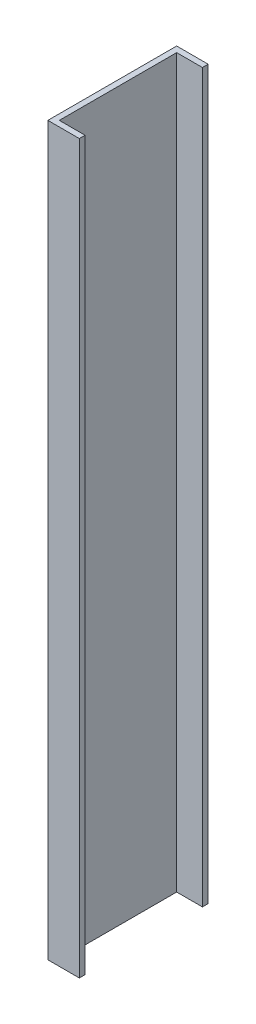
ISO-10303-21;
HEADER;
FILE_DESCRIPTION(('STEP AP214'),'2;1');
FILE_NAME('part.step','',(''),(''),'','','');
FILE_SCHEMA(('AUTOMOTIVE_DESIGN { 1 0 10303 214 1 1 1 1 }'));
ENDSEC;
DATA;
#1=APPLICATION_CONTEXT('core data for automotive mechanical design processes');
#2=APPLICATION_PROTOCOL_DEFINITION('international standard','automotive_design',2000,#1);
#3=PRODUCT_CONTEXT('',#1,'mechanical');
#4=PRODUCT('Part','Part','',(#3));
#5=PRODUCT_RELATED_PRODUCT_CATEGORY('part','',(#4));
#6=PRODUCT_DEFINITION_FORMATION('','',#4);
#7=PRODUCT_DEFINITION_CONTEXT('part definition',#1,'design');
#8=PRODUCT_DEFINITION('design','',#6,#7);
#9=PRODUCT_DEFINITION_SHAPE('','',#8);
#10=(LENGTH_UNIT() NAMED_UNIT(*) SI_UNIT(.MILLI.,.METRE.));
#11=(NAMED_UNIT(*) PLANE_ANGLE_UNIT() SI_UNIT($,.RADIAN.));
#12=(NAMED_UNIT(*) SI_UNIT($,.STERADIAN.) SOLID_ANGLE_UNIT());
#13=UNCERTAINTY_MEASURE_WITH_UNIT(LENGTH_MEASURE(1.E-05),#10,'distance_accuracy_value','');
#14=(GEOMETRIC_REPRESENTATION_CONTEXT(3) GLOBAL_UNCERTAINTY_ASSIGNED_CONTEXT((#13)) GLOBAL_UNIT_ASSIGNED_CONTEXT((#10,
#11,#12)) REPRESENTATION_CONTEXT('',''));
#15=CARTESIAN_POINT('',(0.,0.,0.));
#16=DIRECTION('',(0.,0.,1.));
#17=DIRECTION('',(1.,0.,0.));
#18=AXIS2_PLACEMENT_3D('',#15,#16,#17);
#19=CARTESIAN_POINT('',(11.,254.,0.));
#20=DIRECTION('',(0.,0.,-1.));
#21=DIRECTION('',(-1.,0.,0.));
#22=AXIS2_PLACEMENT_3D('',#19,#20,#21);
#23=PLANE('',#22);
#24=DIRECTION('',(1.,0.,0.));
#25=VECTOR('',#24,1.);
#26=CARTESIAN_POINT('',(11.,0.,0.));
#27=LINE('',#26,#25);
#28=CARTESIAN_POINT('',(0.,0.,0.));
#29=VERTEX_POINT('',#28);
#30=CARTESIAN_POINT('',(11.,0.,0.));
#31=VERTEX_POINT('',#30);
#32=EDGE_CURVE('E128',#29,#31,#27,.T.);
#33=ORIENTED_EDGE('',*,*,#32,.T.);
#34=DIRECTION('',(0.,-1.,0.));
#35=VECTOR('',#34,1.);
#36=CARTESIAN_POINT('',(11.,254.,0.));
#37=LINE('',#36,#35);
#38=CARTESIAN_POINT('',(11.,254.,0.));
#39=VERTEX_POINT('',#38);
#40=EDGE_CURVE('E11',#39,#31,#37,.T.);
#41=ORIENTED_EDGE('',*,*,#40,.F.);
#42=DIRECTION('',(1.,0.,0.));
#43=VECTOR('',#42,1.);
#44=CARTESIAN_POINT('',(11.,254.,0.));
#45=LINE('',#44,#43);
#46=CARTESIAN_POINT('',(0.,254.,0.));
#47=VERTEX_POINT('',#46);
#48=EDGE_CURVE('E142',#47,#39,#45,.T.);
#49=ORIENTED_EDGE('',*,*,#48,.F.);
#50=DIRECTION('',(0.,-1.,0.));
#51=VECTOR('',#50,1.);
#52=CARTESIAN_POINT('',(0.,254.,0.));
#53=LINE('',#52,#51);
#54=EDGE_CURVE('E124',#47,#29,#53,.T.);
#55=ORIENTED_EDGE('',*,*,#54,.T.);
#56=EDGE_LOOP('',(#33,#41,#49,#55));
#57=FACE_BOUND('',#56,.T.);
#58=ADVANCED_FACE('F32',(#57),#23,.F.);
#59=CARTESIAN_POINT('',(11.,254.,-2.));
#60=DIRECTION('',(-1.,0.,0.));
#61=DIRECTION('',(0.,0.,1.));
#62=AXIS2_PLACEMENT_3D('',#59,#60,#61);
#63=PLANE('',#62);
#64=DIRECTION('',(0.,0.,-1.));
#65=VECTOR('',#64,1.);
#66=CARTESIAN_POINT('',(11.,0.,-2.));
#67=LINE('',#66,#65);
#68=CARTESIAN_POINT('',(11.,0.,-2.));
#69=VERTEX_POINT('',#68);
#70=EDGE_CURVE('E131',#31,#69,#67,.T.);
#71=ORIENTED_EDGE('',*,*,#70,.T.);
#72=DIRECTION('',(0.,-1.,0.));
#73=VECTOR('',#72,1.);
#74=CARTESIAN_POINT('',(11.,254.,-2.));
#75=LINE('',#74,#73);
#76=CARTESIAN_POINT('',(11.,254.,-2.));
#77=VERTEX_POINT('',#76);
#78=EDGE_CURVE('E40',#77,#69,#75,.T.);
#79=ORIENTED_EDGE('',*,*,#78,.F.);
#80=DIRECTION('',(0.,0.,-1.));
#81=VECTOR('',#80,1.);
#82=CARTESIAN_POINT('',(11.,254.,-2.));
#83=LINE('',#82,#81);
#84=EDGE_CURVE('E91',#39,#77,#83,.T.);
#85=ORIENTED_EDGE('',*,*,#84,.F.);
#86=ORIENTED_EDGE('',*,*,#40,.T.);
#87=EDGE_LOOP('',(#71,#79,#85,#86));
#88=FACE_BOUND('',#87,.T.);
#89=ADVANCED_FACE('F177',(#88),#63,.F.);
#90=CARTESIAN_POINT('',(2.,254.,-2.));
#91=DIRECTION('',(0.,0.,1.));
#92=DIRECTION('',(1.,0.,0.));
#93=AXIS2_PLACEMENT_3D('',#90,#91,#92);
#94=PLANE('',#93);
#95=DIRECTION('',(-1.,0.,0.));
#96=VECTOR('',#95,1.);
#97=CARTESIAN_POINT('',(2.,0.,-2.));
#98=LINE('',#97,#96);
#99=CARTESIAN_POINT('',(2.,0.,-2.));
#100=VERTEX_POINT('',#99);
#101=EDGE_CURVE('E133',#69,#100,#98,.T.);
#102=ORIENTED_EDGE('',*,*,#101,.T.);
#103=DIRECTION('',(0.,-1.,0.));
#104=VECTOR('',#103,1.);
#105=CARTESIAN_POINT('',(2.,254.,-2.));
#106=LINE('',#105,#104);
#107=CARTESIAN_POINT('',(2.,254.,-2.));
#108=VERTEX_POINT('',#107);
#109=EDGE_CURVE('E149',#108,#100,#106,.T.);
#110=ORIENTED_EDGE('',*,*,#109,.F.);
#111=DIRECTION('',(-1.,0.,0.));
#112=VECTOR('',#111,1.);
#113=CARTESIAN_POINT('',(2.,254.,-2.));
#114=LINE('',#113,#112);
#115=EDGE_CURVE('E157',#77,#108,#114,.T.);
#116=ORIENTED_EDGE('',*,*,#115,.F.);
#117=ORIENTED_EDGE('',*,*,#78,.T.);
#118=EDGE_LOOP('',(#102,#110,#116,#117));
#119=FACE_BOUND('',#118,.T.);
#120=ADVANCED_FACE('F155',(#119),#94,.F.);
#121=CARTESIAN_POINT('',(2.,254.,-43.));
#122=DIRECTION('',(-1.,0.,0.));
#123=DIRECTION('',(0.,0.,1.));
#124=AXIS2_PLACEMENT_3D('',#121,#122,#123);
#125=PLANE('',#124);
#126=DIRECTION('',(0.,0.,-1.));
#127=VECTOR('',#126,1.);
#128=CARTESIAN_POINT('',(2.,0.,-43.));
#129=LINE('',#128,#127);
#130=CARTESIAN_POINT('',(2.,0.,-43.));
#131=VERTEX_POINT('',#130);
#132=EDGE_CURVE('E135',#100,#131,#129,.T.);
#133=ORIENTED_EDGE('',*,*,#132,.T.);
#134=DIRECTION('',(0.,-1.,0.));
#135=VECTOR('',#134,1.);
#136=CARTESIAN_POINT('',(2.,254.,-43.));
#137=LINE('',#136,#135);
#138=CARTESIAN_POINT('',(2.,254.,-43.));
#139=VERTEX_POINT('',#138);
#140=EDGE_CURVE('E146',#139,#131,#137,.T.);
#141=ORIENTED_EDGE('',*,*,#140,.F.);
#142=DIRECTION('',(0.,0.,-1.));
#143=VECTOR('',#142,1.);
#144=CARTESIAN_POINT('',(2.,254.,-43.));
#145=LINE('',#144,#143);
#146=EDGE_CURVE('E169',#108,#139,#145,.T.);
#147=ORIENTED_EDGE('',*,*,#146,.F.);
#148=ORIENTED_EDGE('',*,*,#109,.T.);
#149=EDGE_LOOP('',(#133,#141,#147,#148));
#150=FACE_BOUND('',#149,.T.);
#151=ADVANCED_FACE('F165',(#150),#125,.F.);
#152=CARTESIAN_POINT('',(11.,254.,-43.));
#153=DIRECTION('',(0.,0.,-1.));
#154=DIRECTION('',(-1.,0.,0.));
#155=AXIS2_PLACEMENT_3D('',#152,#153,#154);
#156=PLANE('',#155);
#157=DIRECTION('',(1.,0.,0.));
#158=VECTOR('',#157,1.);
#159=CARTESIAN_POINT('',(11.,0.,-43.));
#160=LINE('',#159,#158);
#161=CARTESIAN_POINT('',(11.,0.,-43.));
#162=VERTEX_POINT('',#161);
#163=EDGE_CURVE('E137',#131,#162,#160,.T.);
#164=ORIENTED_EDGE('',*,*,#163,.T.);
#165=DIRECTION('',(0.,-1.,0.));
#166=VECTOR('',#165,1.);
#167=CARTESIAN_POINT('',(11.,254.,-43.));
#168=LINE('',#167,#166);
#169=CARTESIAN_POINT('',(11.,254.,-43.));
#170=VERTEX_POINT('',#169);
#171=EDGE_CURVE('E119',#170,#162,#168,.T.);
#172=ORIENTED_EDGE('',*,*,#171,.F.);
#173=DIRECTION('',(1.,0.,0.));
#174=VECTOR('',#173,1.);
#175=CARTESIAN_POINT('',(11.,254.,-43.));
#176=LINE('',#175,#174);
#177=EDGE_CURVE('E110',#139,#170,#176,.T.);
#178=ORIENTED_EDGE('',*,*,#177,.F.);
#179=ORIENTED_EDGE('',*,*,#140,.T.);
#180=EDGE_LOOP('',(#164,#172,#178,#179));
#181=FACE_BOUND('',#180,.T.);
#182=ADVANCED_FACE('F168',(#181),#156,.F.);
#183=CARTESIAN_POINT('',(11.,254.,-45.));
#184=DIRECTION('',(-1.,0.,0.));
#185=DIRECTION('',(0.,0.,1.));
#186=AXIS2_PLACEMENT_3D('',#183,#184,#185);
#187=PLANE('',#186);
#188=DIRECTION('',(0.,0.,-1.));
#189=VECTOR('',#188,1.);
#190=CARTESIAN_POINT('',(11.,0.,-45.));
#191=LINE('',#190,#189);
#192=CARTESIAN_POINT('',(11.,0.,-45.));
#193=VERTEX_POINT('',#192);
#194=EDGE_CURVE('E118',#162,#193,#191,.T.);
#195=ORIENTED_EDGE('',*,*,#194,.T.);
#196=DIRECTION('',(0.,-1.,0.));
#197=VECTOR('',#196,1.);
#198=CARTESIAN_POINT('',(11.,254.,-45.));
#199=LINE('',#198,#197);
#200=CARTESIAN_POINT('',(11.,254.,-45.));
#201=VERTEX_POINT('',#200);
#202=EDGE_CURVE('E115',#201,#193,#199,.T.);
#203=ORIENTED_EDGE('',*,*,#202,.F.);
#204=DIRECTION('',(0.,0.,-1.));
#205=VECTOR('',#204,1.);
#206=CARTESIAN_POINT('',(11.,254.,-45.));
#207=LINE('',#206,#205);
#208=EDGE_CURVE('E104',#170,#201,#207,.T.);
#209=ORIENTED_EDGE('',*,*,#208,.F.);
#210=ORIENTED_EDGE('',*,*,#171,.T.);
#211=EDGE_LOOP('',(#195,#203,#209,#210));
#212=FACE_BOUND('',#211,.T.);
#213=ADVANCED_FACE('F116',(#212),#187,.F.);
#214=CARTESIAN_POINT('',(0.,254.,-45.));
#215=DIRECTION('',(0.,0.,1.));
#216=DIRECTION('',(1.,0.,0.));
#217=AXIS2_PLACEMENT_3D('',#214,#215,#216);
#218=PLANE('',#217);
#219=DIRECTION('',(-1.,0.,0.));
#220=VECTOR('',#219,1.);
#221=CARTESIAN_POINT('',(0.,0.,-45.));
#222=LINE('',#221,#220);
#223=CARTESIAN_POINT('',(0.,0.,-45.));
#224=VERTEX_POINT('',#223);
#225=EDGE_CURVE('E77',#193,#224,#222,.T.);
#226=ORIENTED_EDGE('',*,*,#225,.T.);
#227=DIRECTION('',(0.,-1.,0.));
#228=VECTOR('',#227,1.);
#229=CARTESIAN_POINT('',(0.,254.,-45.));
#230=LINE('',#229,#228);
#231=CARTESIAN_POINT('',(0.,254.,-45.));
#232=VERTEX_POINT('',#231);
#233=EDGE_CURVE('E120',#232,#224,#230,.T.);
#234=ORIENTED_EDGE('',*,*,#233,.F.);
#235=DIRECTION('',(-1.,0.,0.));
#236=VECTOR('',#235,1.);
#237=CARTESIAN_POINT('',(0.,254.,-45.));
#238=LINE('',#237,#236);
#239=EDGE_CURVE('E108',#201,#232,#238,.T.);
#240=ORIENTED_EDGE('',*,*,#239,.F.);
#241=ORIENTED_EDGE('',*,*,#202,.T.);
#242=EDGE_LOOP('',(#226,#234,#240,#241));
#243=FACE_BOUND('',#242,.T.);
#244=ADVANCED_FACE('F122',(#243),#218,.F.);
#245=CARTESIAN_POINT('',(0.,254.,0.));
#246=DIRECTION('',(1.,0.,0.));
#247=DIRECTION('',(0.,0.,-1.));
#248=AXIS2_PLACEMENT_3D('',#245,#246,#247);
#249=PLANE('',#248);
#250=DIRECTION('',(0.,0.,1.));
#251=VECTOR('',#250,1.);
#252=CARTESIAN_POINT('',(0.,0.,0.));
#253=LINE('',#252,#251);
#254=EDGE_CURVE('E83',#224,#29,#253,.T.);
#255=ORIENTED_EDGE('',*,*,#254,.T.);
#256=ORIENTED_EDGE('',*,*,#54,.F.);
#257=DIRECTION('',(0.,0.,1.));
#258=VECTOR('',#257,1.);
#259=CARTESIAN_POINT('',(0.,254.,0.));
#260=LINE('',#259,#258);
#261=EDGE_CURVE('E48',#232,#47,#260,.T.);
#262=ORIENTED_EDGE('',*,*,#261,.F.);
#263=ORIENTED_EDGE('',*,*,#233,.T.);
#264=EDGE_LOOP('',(#255,#256,#262,#263));
#265=FACE_BOUND('',#264,.T.);
#266=ADVANCED_FACE('F193',(#265),#249,.F.);
#267=CARTESIAN_POINT('',(0.,254.,0.));
#268=DIRECTION('',(0.,-1.,0.));
#269=DIRECTION('',(0.,0.,-1.));
#270=AXIS2_PLACEMENT_3D('',#267,#268,#269);
#271=PLANE('',#270);
#272=ORIENTED_EDGE('',*,*,#48,.T.);
#273=ORIENTED_EDGE('',*,*,#84,.T.);
#274=ORIENTED_EDGE('',*,*,#115,.T.);
#275=ORIENTED_EDGE('',*,*,#146,.T.);
#276=ORIENTED_EDGE('',*,*,#177,.T.);
#277=ORIENTED_EDGE('',*,*,#208,.T.);
#278=ORIENTED_EDGE('',*,*,#239,.T.);
#279=ORIENTED_EDGE('',*,*,#261,.T.);
#280=EDGE_LOOP('',(#272,#273,#274,#275,#276,#277,#278,#279));
#281=FACE_BOUND('',#280,.T.);
#282=ADVANCED_FACE('F106',(#281),#271,.F.);
#283=CARTESIAN_POINT('',(0.,0.,0.));
#284=DIRECTION('',(0.,-1.,0.));
#285=DIRECTION('',(0.,0.,-1.));
#286=AXIS2_PLACEMENT_3D('',#283,#284,#285);
#287=PLANE('',#286);
#288=ORIENTED_EDGE('',*,*,#32,.F.);
#289=ORIENTED_EDGE('',*,*,#254,.F.);
#290=ORIENTED_EDGE('',*,*,#225,.F.);
#291=ORIENTED_EDGE('',*,*,#194,.F.);
#292=ORIENTED_EDGE('',*,*,#163,.F.);
#293=ORIENTED_EDGE('',*,*,#132,.F.);
#294=ORIENTED_EDGE('',*,*,#101,.F.);
#295=ORIENTED_EDGE('',*,*,#70,.F.);
#296=EDGE_LOOP('',(#288,#289,#290,#291,#292,#293,#294,#295));
#297=FACE_BOUND('',#296,.T.);
#298=ADVANCED_FACE('F161',(#297),#287,.T.);
#299=CLOSED_SHELL('',(#58,#89,#120,#151,#182,#213,#244,#266,#282,#298));
#300=MANIFOLD_SOLID_BREP('B2',#299);
#301=ADVANCED_BREP_SHAPE_REPRESENTATION('',(#18,#300),#14);
#302=SHAPE_DEFINITION_REPRESENTATION(#9,#301);
ENDSEC;
END-ISO-10303-21;
